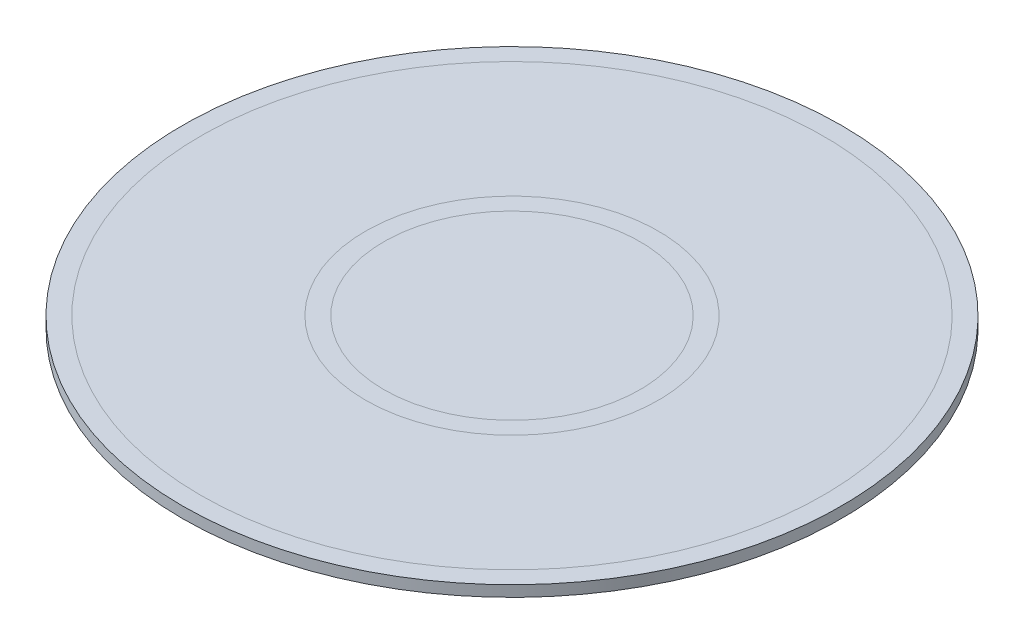
ISO-10303-21;
HEADER;
FILE_DESCRIPTION(('STEP AP214'),'2;1');
FILE_NAME('part.step','',(''),(''),'','','');
FILE_SCHEMA(('AUTOMOTIVE_DESIGN { 1 0 10303 214 1 1 1 1 }'));
ENDSEC;
DATA;
#1=APPLICATION_CONTEXT('core data for automotive mechanical design processes');
#2=APPLICATION_PROTOCOL_DEFINITION('international standard','automotive_design',2000,#1);
#3=PRODUCT_CONTEXT('',#1,'mechanical');
#4=PRODUCT('Part','Part','',(#3));
#5=PRODUCT_RELATED_PRODUCT_CATEGORY('part','',(#4));
#6=PRODUCT_DEFINITION_FORMATION('','',#4);
#7=PRODUCT_DEFINITION_CONTEXT('part definition',#1,'design');
#8=PRODUCT_DEFINITION('design','',#6,#7);
#9=PRODUCT_DEFINITION_SHAPE('','',#8);
#10=(LENGTH_UNIT() NAMED_UNIT(*) SI_UNIT(.MILLI.,.METRE.));
#11=(NAMED_UNIT(*) PLANE_ANGLE_UNIT() SI_UNIT($,.RADIAN.));
#12=(NAMED_UNIT(*) SI_UNIT($,.STERADIAN.) SOLID_ANGLE_UNIT());
#13=UNCERTAINTY_MEASURE_WITH_UNIT(LENGTH_MEASURE(1.E-05),#10,'distance_accuracy_value','');
#14=(GEOMETRIC_REPRESENTATION_CONTEXT(3) GLOBAL_UNCERTAINTY_ASSIGNED_CONTEXT((#13)) GLOBAL_UNIT_ASSIGNED_CONTEXT((#10,
#11,#12)) REPRESENTATION_CONTEXT('',''));
#15=CARTESIAN_POINT('',(0.,0.,0.));
#16=DIRECTION('',(0.,0.,1.));
#17=DIRECTION('',(1.,0.,0.));
#18=AXIS2_PLACEMENT_3D('',#15,#16,#17);
#19=CARTESIAN_POINT('',(0.,0.,0.));
#20=DIRECTION('',(0.,1.,0.));
#21=DIRECTION('',(0.,0.,1.));
#22=AXIS2_PLACEMENT_3D('',#19,#20,#21);
#23=PLANE('',#22);
#24=CARTESIAN_POINT('',(0.,0.,0.));
#25=DIRECTION('',(0.,1.,0.));
#26=DIRECTION('',(0.,0.,1.));
#27=AXIS2_PLACEMENT_3D('',#24,#25,#26);
#28=CIRCLE('',#27,3.5);
#29=CARTESIAN_POINT('',(0.,0.,3.5));
#30=VERTEX_POINT('',#29);
#31=EDGE_CURVE('E14',#30,#30,#28,.F.);
#32=ORIENTED_EDGE('',*,*,#31,.T.);
#33=EDGE_LOOP('',(#32));
#34=FACE_BOUND('',#33,.T.);
#35=ADVANCED_FACE('F323',(#34),#23,.F.);
#36=ORIENTED_EDGE('',*,*,#31,.F.);
#37=EDGE_LOOP('',(#36));
#38=FACE_BOUND('',#37,.T.);
#39=CARTESIAN_POINT('',(0.,0.,0.));
#40=DIRECTION('',(0.,1.,0.));
#41=DIRECTION('',(0.,0.,1.));
#42=AXIS2_PLACEMENT_3D('',#39,#40,#41);
#43=CIRCLE('',#42,4.);
#44=CARTESIAN_POINT('',(0.,0.,4.));
#45=VERTEX_POINT('',#44);
#46=EDGE_CURVE('E331',#45,#45,#43,.F.);
#47=ORIENTED_EDGE('',*,*,#46,.T.);
#48=EDGE_LOOP('',(#47));
#49=FACE_BOUND('',#48,.T.);
#50=ADVANCED_FACE('F389',(#38,#49),#23,.F.);
#51=ORIENTED_EDGE('',*,*,#46,.F.);
#52=EDGE_LOOP('',(#51));
#53=FACE_BOUND('',#52,.T.);
#54=CARTESIAN_POINT('',(0.,0.,0.));
#55=DIRECTION('',(0.,1.,0.));
#56=DIRECTION('',(0.,0.,1.));
#57=AXIS2_PLACEMENT_3D('',#54,#55,#56);
#58=CIRCLE('',#57,8.5);
#59=CARTESIAN_POINT('',(0.,0.,8.5));
#60=VERTEX_POINT('',#59);
#61=EDGE_CURVE('E339',#60,#60,#58,.F.);
#62=ORIENTED_EDGE('',*,*,#61,.T.);
#63=EDGE_LOOP('',(#62));
#64=FACE_BOUND('',#63,.T.);
#65=ADVANCED_FACE('F380',(#53,#64),#23,.F.);
#66=CARTESIAN_POINT('',(0.,0.3,0.));
#67=DIRECTION('',(0.,1.,0.));
#68=DIRECTION('',(0.,0.,1.));
#69=AXIS2_PLACEMENT_3D('',#66,#67,#68);
#70=PLANE('',#69);
#71=CARTESIAN_POINT('',(0.,0.3,0.));
#72=DIRECTION('',(0.,1.,0.));
#73=DIRECTION('',(0.,0.,1.));
#74=AXIS2_PLACEMENT_3D('',#71,#72,#73);
#75=CIRCLE('',#74,3.5);
#76=CARTESIAN_POINT('',(0.,0.3,3.5));
#77=VERTEX_POINT('',#76);
#78=EDGE_CURVE('E346',#77,#77,#75,.T.);
#79=ORIENTED_EDGE('',*,*,#78,.T.);
#80=EDGE_LOOP('',(#79));
#81=FACE_BOUND('',#80,.T.);
#82=ADVANCED_FACE('F386',(#81),#70,.T.);
#83=ORIENTED_EDGE('',*,*,#78,.F.);
#84=EDGE_LOOP('',(#83));
#85=FACE_BOUND('',#84,.T.);
#86=CARTESIAN_POINT('',(0.,0.3,0.));
#87=DIRECTION('',(0.,1.,0.));
#88=DIRECTION('',(0.,0.,1.));
#89=AXIS2_PLACEMENT_3D('',#86,#87,#88);
#90=CIRCLE('',#89,4.);
#91=CARTESIAN_POINT('',(0.,0.3,4.));
#92=VERTEX_POINT('',#91);
#93=EDGE_CURVE('E352',#92,#92,#90,.T.);
#94=ORIENTED_EDGE('',*,*,#93,.T.);
#95=EDGE_LOOP('',(#94));
#96=FACE_BOUND('',#95,.T.);
#97=ADVANCED_FACE('F396',(#85,#96),#70,.T.);
#98=ORIENTED_EDGE('',*,*,#93,.F.);
#99=EDGE_LOOP('',(#98));
#100=FACE_BOUND('',#99,.T.);
#101=CARTESIAN_POINT('',(0.,0.3,0.));
#102=DIRECTION('',(0.,1.,0.));
#103=DIRECTION('',(0.,0.,1.));
#104=AXIS2_PLACEMENT_3D('',#101,#102,#103);
#105=CIRCLE('',#104,8.5);
#106=CARTESIAN_POINT('',(0.,0.3,8.5));
#107=VERTEX_POINT('',#106);
#108=EDGE_CURVE('E356',#107,#107,#105,.T.);
#109=ORIENTED_EDGE('',*,*,#108,.T.);
#110=EDGE_LOOP('',(#109));
#111=FACE_BOUND('',#110,.T.);
#112=ADVANCED_FACE('F374',(#100,#111),#70,.T.);
#113=CARTESIAN_POINT('',(0.,0.3,0.));
#114=DIRECTION('',(0.,-1.,0.));
#115=DIRECTION('',(0.,0.,-1.));
#116=AXIS2_PLACEMENT_3D('',#113,#114,#115);
#117=CYLINDRICAL_SURFACE('',#116,9.);
#118=CARTESIAN_POINT('',(0.,0.3,0.));
#119=DIRECTION('',(0.,1.,0.));
#120=DIRECTION('',(0.,0.,1.));
#121=AXIS2_PLACEMENT_3D('',#118,#119,#120);
#122=CIRCLE('',#121,9.);
#123=CARTESIAN_POINT('',(0.,0.3,9.));
#124=VERTEX_POINT('',#123);
#125=EDGE_CURVE('E360',#124,#124,#122,.T.);
#126=ORIENTED_EDGE('',*,*,#125,.F.);
#127=EDGE_LOOP('',(#126));
#128=FACE_BOUND('',#127,.T.);
#129=CARTESIAN_POINT('',(0.,0.,0.));
#130=DIRECTION('',(0.,1.,0.));
#131=DIRECTION('',(0.,0.,1.));
#132=AXIS2_PLACEMENT_3D('',#129,#130,#131);
#133=CIRCLE('',#132,9.);
#134=CARTESIAN_POINT('',(0.,0.,9.));
#135=VERTEX_POINT('',#134);
#136=EDGE_CURVE('E361',#135,#135,#133,.T.);
#137=ORIENTED_EDGE('',*,*,#136,.T.);
#138=EDGE_LOOP('',(#137));
#139=FACE_BOUND('',#138,.T.);
#140=ADVANCED_FACE('F325',(#128,#139),#117,.T.);
#141=ORIENTED_EDGE('',*,*,#108,.F.);
#142=EDGE_LOOP('',(#141));
#143=FACE_BOUND('',#142,.T.);
#144=ORIENTED_EDGE('',*,*,#125,.T.);
#145=EDGE_LOOP('',(#144));
#146=FACE_BOUND('',#145,.T.);
#147=ADVANCED_FACE('F370',(#143,#146),#70,.T.);
#148=ORIENTED_EDGE('',*,*,#61,.F.);
#149=EDGE_LOOP('',(#148));
#150=FACE_BOUND('',#149,.T.);
#151=ORIENTED_EDGE('',*,*,#136,.F.);
#152=EDGE_LOOP('',(#151));
#153=FACE_BOUND('',#152,.T.);
#154=ADVANCED_FACE('F377',(#150,#153),#23,.F.);
#155=CLOSED_SHELL('',(#35,#50,#65,#82,#97,#112,#140,#147,#154));
#156=MANIFOLD_SOLID_BREP('B2',#155);
#157=ADVANCED_BREP_SHAPE_REPRESENTATION('',(#18,#156),#14);
#158=SHAPE_DEFINITION_REPRESENTATION(#9,#157);
ENDSEC;
END-ISO-10303-21;
